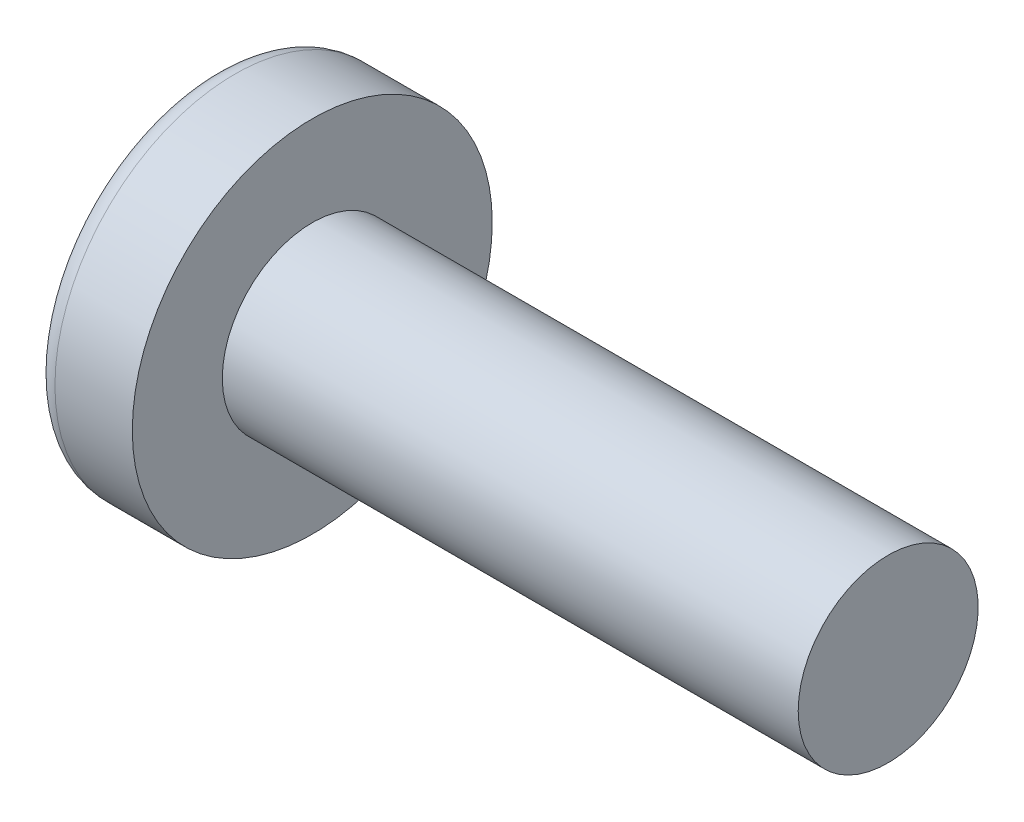
ISO-10303-21;
HEADER;
FILE_DESCRIPTION(('STEP AP214'),'2;1');
FILE_NAME('part.step','',(''),(''),'','','');
FILE_SCHEMA(('AUTOMOTIVE_DESIGN { 1 0 10303 214 1 1 1 1 }'));
ENDSEC;
DATA;
#1=APPLICATION_CONTEXT('core data for automotive mechanical design processes');
#2=APPLICATION_PROTOCOL_DEFINITION('international standard','automotive_design',2000,#1);
#3=PRODUCT_CONTEXT('',#1,'mechanical');
#4=PRODUCT('Part','Part','',(#3));
#5=PRODUCT_RELATED_PRODUCT_CATEGORY('part','',(#4));
#6=PRODUCT_DEFINITION_FORMATION('','',#4);
#7=PRODUCT_DEFINITION_CONTEXT('part definition',#1,'design');
#8=PRODUCT_DEFINITION('design','',#6,#7);
#9=PRODUCT_DEFINITION_SHAPE('','',#8);
#10=(LENGTH_UNIT() NAMED_UNIT(*) SI_UNIT(.MILLI.,.METRE.));
#11=(NAMED_UNIT(*) PLANE_ANGLE_UNIT() SI_UNIT($,.RADIAN.));
#12=(NAMED_UNIT(*) SI_UNIT($,.STERADIAN.) SOLID_ANGLE_UNIT());
#13=UNCERTAINTY_MEASURE_WITH_UNIT(LENGTH_MEASURE(1.E-05),#10,'distance_accuracy_value','');
#14=(GEOMETRIC_REPRESENTATION_CONTEXT(3) GLOBAL_UNCERTAINTY_ASSIGNED_CONTEXT((#13)) GLOBAL_UNIT_ASSIGNED_CONTEXT((#10,
#11,#12)) REPRESENTATION_CONTEXT('',''));
#15=CARTESIAN_POINT('',(0.,0.,0.));
#16=DIRECTION('',(0.,0.,1.));
#17=DIRECTION('',(1.,0.,0.));
#18=AXIS2_PLACEMENT_3D('',#15,#16,#17);
#19=CARTESIAN_POINT('',(4.,0.,0.));
#20=DIRECTION('',(-1.,0.,0.));
#21=DIRECTION('',(0.,1.,0.));
#22=AXIS2_PLACEMENT_3D('',#19,#20,#21);
#23=SPHERICAL_SURFACE('',#22,4.);
#24=CARTESIAN_POINT('',(0.783897344725729,0.,0.));
#25=DIRECTION('',(-1.,0.,0.));
#26=DIRECTION('',(0.,0.,1.));
#27=AXIS2_PLACEMENT_3D('',#24,#25,#26);
#28=CIRCLE('',#27,2.37837837837838);
#29=CARTESIAN_POINT('',(0.783897344725729,0.,2.37837837837838));
#30=VERTEX_POINT('',#29);
#31=EDGE_CURVE('E152',#30,#30,#28,.T.);
#32=ORIENTED_EDGE('',*,*,#31,.T.);
#33=EDGE_LOOP('',(#32));
#34=FACE_BOUND('',#33,.T.);
#35=CARTESIAN_POINT('',(3.98786118636742,-0.106127913473398,0.));
#36=DIRECTION('',(-0.11363816050966,-0.993522203313032,0.));
#37=DIRECTION('',(0.993522203313032,-0.11363816050966,0.));
#38=AXIS2_PLACEMENT_3D('',#35,#36,#37);
#39=CIRCLE('',#38,3.99857343501221);
#40=CARTESIAN_POINT('',(0.195539940029893,0.327634320584812,1.19110847703606));
#41=VERTEX_POINT('',#40);
#42=CARTESIAN_POINT('',(0.0301382525496408,0.346552814250857,0.346552814250858));
#43=VERTEX_POINT('',#42);
#44=EDGE_CURVE('E183',#41,#43,#39,.T.);
#45=ORIENTED_EDGE('',*,*,#44,.F.);
#46=CARTESIAN_POINT('',(3.17784904512422,0.,-1.07973473043772));
#47=DIRECTION('',(0.605808178465614,0.,0.795610740817502));
#48=DIRECTION('',(0.795610740817502,0.,-0.605808178465614));
#49=AXIS2_PLACEMENT_3D('',#46,#47,#48);
#50=CIRCLE('',#49,3.76274377539628);
#51=CARTESIAN_POINT('',(0.195539940029892,-0.32763432058482,1.19110847703606));
#52=VERTEX_POINT('',#51);
#53=EDGE_CURVE('E148',#41,#52,#50,.T.);
#54=ORIENTED_EDGE('',*,*,#53,.T.);
#55=CARTESIAN_POINT('',(3.98786118636742,0.106127913473397,0.));
#56=DIRECTION('',(-0.11363816050966,0.993522203313032,0.));
#57=DIRECTION('',(-0.993522203313032,-0.11363816050966,0.));
#58=AXIS2_PLACEMENT_3D('',#55,#56,#57);
#59=CIRCLE('',#58,3.99857343501221);
#60=CARTESIAN_POINT('',(0.0301382525496399,-0.346552814250859,0.346552814250858));
#61=VERTEX_POINT('',#60);
#62=EDGE_CURVE('E104',#61,#52,#59,.T.);
#63=ORIENTED_EDGE('',*,*,#62,.F.);
#64=CARTESIAN_POINT('',(3.98786118636742,0.,-0.106127913473397));
#65=DIRECTION('',(-0.11363816050966,0.,-0.993522203313032));
#66=DIRECTION('',(-0.993522203313032,0.,0.11363816050966));
#67=AXIS2_PLACEMENT_3D('',#64,#65,#66);
#68=CIRCLE('',#67,3.99857343501221);
#69=CARTESIAN_POINT('',(0.195539940029891,-1.19110847703606,0.327634320584816));
#70=VERTEX_POINT('',#69);
#71=EDGE_CURVE('E129',#70,#61,#68,.T.);
#72=ORIENTED_EDGE('',*,*,#71,.F.);
#73=CARTESIAN_POINT('',(3.17784904512422,1.07973473043772,0.));
#74=DIRECTION('',(0.605808178465614,-0.795610740817502,0.));
#75=DIRECTION('',(0.795610740817502,0.605808178465614,0.));
#76=AXIS2_PLACEMENT_3D('',#73,#74,#75);
#77=CIRCLE('',#76,3.76274377539627);
#78=CARTESIAN_POINT('',(0.195539940029891,-1.19110847703606,-0.327634320584816));
#79=VERTEX_POINT('',#78);
#80=EDGE_CURVE('E137',#70,#79,#77,.T.);
#81=ORIENTED_EDGE('',*,*,#80,.T.);
#82=CARTESIAN_POINT('',(3.98786118636742,0.,0.106127913473398));
#83=DIRECTION('',(-0.11363816050966,0.,0.993522203313032));
#84=DIRECTION('',(0.993522203313032,0.,0.11363816050966));
#85=AXIS2_PLACEMENT_3D('',#82,#83,#84);
#86=CIRCLE('',#85,3.99857343501221);
#87=CARTESIAN_POINT('',(0.0301382525496399,-0.346552814250856,-0.346552814250858));
#88=VERTEX_POINT('',#87);
#89=EDGE_CURVE('E47',#88,#79,#86,.T.);
#90=ORIENTED_EDGE('',*,*,#89,.F.);
#91=CARTESIAN_POINT('',(0.195539940029892,-0.327634320584811,-1.19110847703606));
#92=VERTEX_POINT('',#91);
#93=EDGE_CURVE('E190',#92,#88,#59,.T.);
#94=ORIENTED_EDGE('',*,*,#93,.F.);
#95=CARTESIAN_POINT('',(3.17784904512422,0.,1.07973473043772));
#96=DIRECTION('',(0.605808178465614,0.,-0.795610740817502));
#97=DIRECTION('',(-0.795610740817502,0.,-0.605808178465614));
#98=AXIS2_PLACEMENT_3D('',#95,#96,#97);
#99=CIRCLE('',#98,3.76274377539628);
#100=CARTESIAN_POINT('',(0.195539940029893,0.32763432058482,-1.19110847703606));
#101=VERTEX_POINT('',#100);
#102=EDGE_CURVE('E130',#92,#101,#99,.T.);
#103=ORIENTED_EDGE('',*,*,#102,.T.);
#104=CARTESIAN_POINT('',(0.0301382525496408,0.346552814250859,-0.346552814250858));
#105=VERTEX_POINT('',#104);
#106=EDGE_CURVE('E178',#105,#101,#39,.T.);
#107=ORIENTED_EDGE('',*,*,#106,.F.);
#108=CARTESIAN_POINT('',(0.195539940029894,1.19110847703606,-0.327634320584816));
#109=VERTEX_POINT('',#108);
#110=EDGE_CURVE('E40',#109,#105,#86,.T.);
#111=ORIENTED_EDGE('',*,*,#110,.F.);
#112=CARTESIAN_POINT('',(3.17784904512422,-1.07973473043772,0.));
#113=DIRECTION('',(0.605808178465614,0.795610740817502,0.));
#114=DIRECTION('',(-0.795610740817502,0.605808178465614,0.));
#115=AXIS2_PLACEMENT_3D('',#112,#113,#114);
#116=CIRCLE('',#115,3.76274377539628);
#117=CARTESIAN_POINT('',(0.195539940029894,1.19110847703606,0.327634320584816));
#118=VERTEX_POINT('',#117);
#119=EDGE_CURVE('E11',#109,#118,#116,.T.);
#120=ORIENTED_EDGE('',*,*,#119,.T.);
#121=EDGE_CURVE('E166',#43,#118,#68,.T.);
#122=ORIENTED_EDGE('',*,*,#121,.F.);
#123=EDGE_LOOP('',(#45,#54,#63,#72,#81,#90,#94,#103,#107,#111,#120,#122));
#124=FACE_BOUND('',#123,.T.);
#125=ADVANCED_FACE('F32',(#34,#124),#23,.T.);
#126=CARTESIAN_POINT('',(1.75982832618026,0.,-0.148712446351931));
#127=DIRECTION('',(-0.11363816050966,0.,0.993522203313032));
#128=DIRECTION('',(0.993522203313032,0.,0.11363816050966));
#129=AXIS2_PLACEMENT_3D('',#126,#127,#128);
#130=PLANE('',#129);
#131=ORIENTED_EDGE('',*,*,#110,.T.);
#132=DIRECTION('',(0.987168682960152,-0.112911450665377,0.112911450665377));
#133=VECTOR('',#132,1.);
#134=CARTESIAN_POINT('',(1.77640420924781,0.146816512014139,-0.146816512014139));
#135=LINE('',#134,#133);
#136=CARTESIAN_POINT('',(1.53,0.175000000000001,-0.174999999999999));
#137=VERTEX_POINT('',#136);
#138=EDGE_CURVE('E172',#105,#137,#135,.T.);
#139=ORIENTED_EDGE('',*,*,#138,.T.);
#140=DIRECTION('',(0.792336746135061,-0.603315234802187,0.0906267520089123));
#141=VECTOR('',#140,1.);
#142=CARTESIAN_POINT('',(0.,1.34,-0.35));
#143=LINE('',#142,#141);
#144=EDGE_CURVE('E153',#109,#137,#143,.T.);
#145=ORIENTED_EDGE('',*,*,#144,.F.);
#146=EDGE_LOOP('',(#131,#139,#145));
#147=FACE_BOUND('',#146,.T.);
#148=ADVANCED_FACE('F171',(#147),#130,.T.);
#149=DIRECTION('',(0.792336746135062,0.603315234802187,0.0906267520089123));
#150=VECTOR('',#149,1.);
#151=CARTESIAN_POINT('',(0.,-1.34,-0.35));
#152=LINE('',#151,#150);
#153=CARTESIAN_POINT('',(1.53,-0.175,-0.175));
#154=VERTEX_POINT('',#153);
#155=EDGE_CURVE('E138',#79,#154,#152,.T.);
#156=ORIENTED_EDGE('',*,*,#155,.T.);
#157=DIRECTION('',(-0.987168682960152,-0.112911450665376,-0.112911450665377));
#158=VECTOR('',#157,1.);
#159=CARTESIAN_POINT('',(1.77640420924781,-0.146816512014139,-0.146816512014139));
#160=LINE('',#159,#158);
#161=EDGE_CURVE('E193',#154,#88,#160,.T.);
#162=ORIENTED_EDGE('',*,*,#161,.T.);
#163=ORIENTED_EDGE('',*,*,#89,.T.);
#164=EDGE_LOOP('',(#156,#162,#163));
#165=FACE_BOUND('',#164,.T.);
#166=ADVANCED_FACE('F208',(#165),#130,.T.);
#167=CARTESIAN_POINT('',(1.75982832618026,0.,0.148712446351931));
#168=DIRECTION('',(-0.11363816050966,0.,-0.993522203313032));
#169=DIRECTION('',(-0.993522203313032,0.,0.11363816050966));
#170=AXIS2_PLACEMENT_3D('',#167,#168,#169);
#171=PLANE('',#170);
#172=DIRECTION('',(0.792336746135061,-0.603315234802187,-0.0906267520089121));
#173=VECTOR('',#172,1.);
#174=CARTESIAN_POINT('',(0.,1.34,0.35));
#175=LINE('',#174,#173);
#176=CARTESIAN_POINT('',(1.53,0.175,0.175));
#177=VERTEX_POINT('',#176);
#178=EDGE_CURVE('E209',#118,#177,#175,.T.);
#179=ORIENTED_EDGE('',*,*,#178,.T.);
#180=DIRECTION('',(-0.987168682960152,0.112911450665376,0.112911450665376));
#181=VECTOR('',#180,1.);
#182=CARTESIAN_POINT('',(1.77640420924781,0.146816512014138,0.146816512014139));
#183=LINE('',#182,#181);
#184=EDGE_CURVE('E187',#177,#43,#183,.T.);
#185=ORIENTED_EDGE('',*,*,#184,.T.);
#186=ORIENTED_EDGE('',*,*,#121,.T.);
#187=EDGE_LOOP('',(#179,#185,#186));
#188=FACE_BOUND('',#187,.T.);
#189=ADVANCED_FACE('F213',(#188),#171,.T.);
#190=ORIENTED_EDGE('',*,*,#71,.T.);
#191=DIRECTION('',(0.987168682960152,0.112911450665377,-0.112911450665376));
#192=VECTOR('',#191,1.);
#193=CARTESIAN_POINT('',(1.77640420924781,-0.14681651201414,0.146816512014139));
#194=LINE('',#193,#192);
#195=CARTESIAN_POINT('',(1.53,-0.175000000000001,0.174999999999999));
#196=VERTEX_POINT('',#195);
#197=EDGE_CURVE('E102',#61,#196,#194,.T.);
#198=ORIENTED_EDGE('',*,*,#197,.T.);
#199=DIRECTION('',(0.792336746135062,0.603315234802187,-0.0906267520089119));
#200=VECTOR('',#199,1.);
#201=CARTESIAN_POINT('',(0.,-1.34,0.349999999999999));
#202=LINE('',#201,#200);
#203=EDGE_CURVE('E127',#70,#196,#202,.T.);
#204=ORIENTED_EDGE('',*,*,#203,.F.);
#205=EDGE_LOOP('',(#190,#198,#204));
#206=FACE_BOUND('',#205,.T.);
#207=ADVANCED_FACE('F126',(#206),#171,.T.);
#208=CARTESIAN_POINT('',(-25.4,0.,0.));
#209=DIRECTION('',(-1.,0.,0.));
#210=DIRECTION('',(0.,0.,1.));
#211=AXIS2_PLACEMENT_3D('',#208,#209,#210);
#212=CYLINDRICAL_SURFACE('',#211,1.25);
#213=CARTESIAN_POINT('',(10.1,0.,0.));
#214=DIRECTION('',(-1.,0.,0.));
#215=DIRECTION('',(0.,0.,1.));
#216=AXIS2_PLACEMENT_3D('',#213,#214,#215);
#217=CIRCLE('',#216,1.25);
#218=CARTESIAN_POINT('',(10.1,0.,1.25));
#219=VERTEX_POINT('',#218);
#220=EDGE_CURVE('E149',#219,#219,#217,.T.);
#221=ORIENTED_EDGE('',*,*,#220,.T.);
#222=EDGE_LOOP('',(#221));
#223=FACE_BOUND('',#222,.T.);
#224=CARTESIAN_POINT('',(2.1,0.,0.));
#225=DIRECTION('',(-1.,0.,0.));
#226=DIRECTION('',(0.,0.,1.));
#227=AXIS2_PLACEMENT_3D('',#224,#225,#226);
#228=CIRCLE('',#227,1.25);
#229=CARTESIAN_POINT('',(2.1,0.,1.25));
#230=VERTEX_POINT('',#229);
#231=EDGE_CURVE('E162',#230,#230,#228,.T.);
#232=ORIENTED_EDGE('',*,*,#231,.F.);
#233=EDGE_LOOP('',(#232));
#234=FACE_BOUND('',#233,.T.);
#235=ADVANCED_FACE('F34',(#223,#234),#212,.T.);
#236=CARTESIAN_POINT('',(2.1,1.25,0.));
#237=DIRECTION('',(-1.,0.,0.));
#238=DIRECTION('',(0.,0.,1.));
#239=AXIS2_PLACEMENT_3D('',#236,#237,#238);
#240=PLANE('',#239);
#241=CARTESIAN_POINT('',(2.1,0.,0.));
#242=DIRECTION('',(-1.,0.,0.));
#243=DIRECTION('',(0.,0.,1.));
#244=AXIS2_PLACEMENT_3D('',#241,#242,#243);
#245=CIRCLE('',#244,2.5);
#246=CARTESIAN_POINT('',(2.1,0.,2.5));
#247=VERTEX_POINT('',#246);
#248=EDGE_CURVE('E159',#247,#247,#245,.T.);
#249=ORIENTED_EDGE('',*,*,#248,.F.);
#250=EDGE_LOOP('',(#249));
#251=FACE_BOUND('',#250,.T.);
#252=ORIENTED_EDGE('',*,*,#231,.T.);
#253=EDGE_LOOP('',(#252));
#254=FACE_BOUND('',#253,.T.);
#255=ADVANCED_FACE('F241',(#251,#254),#240,.F.);
#256=CARTESIAN_POINT('',(-25.4,0.,0.));
#257=DIRECTION('',(-1.,0.,0.));
#258=DIRECTION('',(0.,0.,1.));
#259=AXIS2_PLACEMENT_3D('',#256,#257,#258);
#260=CYLINDRICAL_SURFACE('',#259,2.5);
#261=ORIENTED_EDGE('',*,*,#248,.T.);
#262=EDGE_LOOP('',(#261));
#263=FACE_BOUND('',#262,.T.);
#264=CARTESIAN_POINT('',(1.0251050438713,0.,0.));
#265=DIRECTION('',(-1.,0.,0.));
#266=DIRECTION('',(0.,0.,1.));
#267=AXIS2_PLACEMENT_3D('',#264,#265,#266);
#268=CIRCLE('',#267,2.5);
#269=CARTESIAN_POINT('',(1.0251050438713,0.,2.5));
#270=VERTEX_POINT('',#269);
#271=EDGE_CURVE('E156',#270,#270,#268,.T.);
#272=ORIENTED_EDGE('',*,*,#271,.F.);
#273=EDGE_LOOP('',(#272));
#274=FACE_BOUND('',#273,.T.);
#275=ADVANCED_FACE('F238',(#263,#274),#260,.T.);
#276=CARTESIAN_POINT('',(1.0251050438713,0.,0.));
#277=DIRECTION('',(-1.,0.,0.));
#278=DIRECTION('',(0.,0.,1.));
#279=AXIS2_PLACEMENT_3D('',#276,#277,#278);
#280=TOROIDAL_SURFACE('',#279,2.2,0.3);
#281=ORIENTED_EDGE('',*,*,#271,.T.);
#282=EDGE_LOOP('',(#281));
#283=FACE_BOUND('',#282,.T.);
#284=ORIENTED_EDGE('',*,*,#31,.F.);
#285=EDGE_LOOP('',(#284));
#286=FACE_BOUND('',#285,.T.);
#287=ADVANCED_FACE('F235',(#283,#286),#280,.T.);
#288=CARTESIAN_POINT('',(10.1,1.25,0.));
#289=DIRECTION('',(1.,0.,0.));
#290=DIRECTION('',(0.,0.,-1.));
#291=AXIS2_PLACEMENT_3D('',#288,#289,#290);
#292=PLANE('',#291);
#293=ORIENTED_EDGE('',*,*,#220,.F.);
#294=EDGE_LOOP('',(#293));
#295=FACE_BOUND('',#294,.T.);
#296=ADVANCED_FACE('F233',(#295),#292,.T.);
#297=CARTESIAN_POINT('',(0.,1.34,0.35));
#298=DIRECTION('',(0.605808178465614,0.795610740817502,0.));
#299=DIRECTION('',(-0.795610740817502,0.605808178465614,0.));
#300=AXIS2_PLACEMENT_3D('',#297,#298,#299);
#301=PLANE('',#300);
#302=ORIENTED_EDGE('',*,*,#144,.T.);
#303=DIRECTION('',(0.,0.,-1.));
#304=VECTOR('',#303,1.);
#305=CARTESIAN_POINT('',(1.53,0.175,0.175));
#306=LINE('',#305,#304);
#307=EDGE_CURVE('E120',#177,#137,#306,.T.);
#308=ORIENTED_EDGE('',*,*,#307,.F.);
#309=ORIENTED_EDGE('',*,*,#178,.F.);
#310=ORIENTED_EDGE('',*,*,#119,.F.);
#311=EDGE_LOOP('',(#302,#308,#309,#310));
#312=FACE_BOUND('',#311,.T.);
#313=ADVANCED_FACE('F212',(#312),#301,.F.);
#314=CARTESIAN_POINT('',(0.,-1.34,-0.35));
#315=DIRECTION('',(0.605808178465614,-0.795610740817502,0.));
#316=DIRECTION('',(0.795610740817502,0.605808178465614,0.));
#317=AXIS2_PLACEMENT_3D('',#314,#315,#316);
#318=PLANE('',#317);
#319=ORIENTED_EDGE('',*,*,#203,.T.);
#320=DIRECTION('',(0.,0.,1.));
#321=VECTOR('',#320,1.);
#322=CARTESIAN_POINT('',(1.53,-0.175,-0.175));
#323=LINE('',#322,#321);
#324=EDGE_CURVE('E119',#154,#196,#323,.T.);
#325=ORIENTED_EDGE('',*,*,#324,.F.);
#326=ORIENTED_EDGE('',*,*,#155,.F.);
#327=ORIENTED_EDGE('',*,*,#80,.F.);
#328=EDGE_LOOP('',(#319,#325,#326,#327));
#329=FACE_BOUND('',#328,.T.);
#330=ADVANCED_FACE('F134',(#329),#318,.F.);
#331=CARTESIAN_POINT('',(1.53,0.175,-0.175));
#332=DIRECTION('',(-1.,0.,0.));
#333=DIRECTION('',(0.,0.,1.));
#334=AXIS2_PLACEMENT_3D('',#331,#332,#333);
#335=PLANE('',#334);
#336=DIRECTION('',(0.,1.,0.));
#337=VECTOR('',#336,1.);
#338=CARTESIAN_POINT('',(1.53,-0.175,-0.175));
#339=LINE('',#338,#337);
#340=EDGE_CURVE('E142',#154,#137,#339,.T.);
#341=ORIENTED_EDGE('',*,*,#340,.F.);
#342=ORIENTED_EDGE('',*,*,#324,.T.);
#343=DIRECTION('',(0.,-1.,0.));
#344=VECTOR('',#343,1.);
#345=CARTESIAN_POINT('',(1.53,0.175,0.175));
#346=LINE('',#345,#344);
#347=EDGE_CURVE('E111',#177,#196,#346,.T.);
#348=ORIENTED_EDGE('',*,*,#347,.F.);
#349=ORIENTED_EDGE('',*,*,#307,.T.);
#350=EDGE_LOOP('',(#341,#342,#348,#349));
#351=FACE_BOUND('',#350,.T.);
#352=ADVANCED_FACE('F140',(#351),#335,.T.);
#353=CARTESIAN_POINT('',(0.,0.350000000000005,-1.34));
#354=DIRECTION('',(0.605808178465614,0.,-0.795610740817502));
#355=DIRECTION('',(0.795610740817502,0.,0.605808178465614));
#356=AXIS2_PLACEMENT_3D('',#353,#354,#355);
#357=PLANE('',#356);
#358=DIRECTION('',(0.792336746135062,0.0906267520089098,0.603315234802187));
#359=VECTOR('',#358,1.);
#360=CARTESIAN_POINT('',(0.,-0.349999999999995,-1.34));
#361=LINE('',#360,#359);
#362=EDGE_CURVE('E198',#92,#154,#361,.T.);
#363=ORIENTED_EDGE('',*,*,#362,.T.);
#364=ORIENTED_EDGE('',*,*,#340,.T.);
#365=DIRECTION('',(0.792336746135062,-0.0906267520089144,0.603315234802187));
#366=VECTOR('',#365,1.);
#367=CARTESIAN_POINT('',(0.,0.350000000000005,-1.34));
#368=LINE('',#367,#366);
#369=EDGE_CURVE('E108',#101,#137,#368,.T.);
#370=ORIENTED_EDGE('',*,*,#369,.F.);
#371=ORIENTED_EDGE('',*,*,#102,.F.);
#372=EDGE_LOOP('',(#363,#364,#370,#371));
#373=FACE_BOUND('',#372,.T.);
#374=ADVANCED_FACE('F203',(#373),#357,.F.);
#375=CARTESIAN_POINT('',(1.75982832618026,-0.148712446351931,0.));
#376=DIRECTION('',(-0.11363816050966,0.993522203313032,0.));
#377=DIRECTION('',(-0.993522203313032,-0.11363816050966,0.));
#378=AXIS2_PLACEMENT_3D('',#375,#376,#377);
#379=PLANE('',#378);
#380=ORIENTED_EDGE('',*,*,#93,.T.);
#381=ORIENTED_EDGE('',*,*,#161,.F.);
#382=ORIENTED_EDGE('',*,*,#362,.F.);
#383=EDGE_LOOP('',(#380,#381,#382));
#384=FACE_BOUND('',#383,.T.);
#385=ADVANCED_FACE('F207',(#384),#379,.T.);
#386=CARTESIAN_POINT('',(1.75982832618026,0.148712446351931,0.));
#387=DIRECTION('',(-0.11363816050966,-0.993522203313032,0.));
#388=DIRECTION('',(0.993522203313032,-0.11363816050966,0.));
#389=AXIS2_PLACEMENT_3D('',#386,#387,#388);
#390=PLANE('',#389);
#391=ORIENTED_EDGE('',*,*,#106,.T.);
#392=ORIENTED_EDGE('',*,*,#369,.T.);
#393=ORIENTED_EDGE('',*,*,#138,.F.);
#394=EDGE_LOOP('',(#391,#392,#393));
#395=FACE_BOUND('',#394,.T.);
#396=ADVANCED_FACE('F201',(#395),#390,.T.);
#397=CARTESIAN_POINT('',(0.,-0.350000000000004,1.34));
#398=DIRECTION('',(0.605808178465614,0.,0.795610740817502));
#399=DIRECTION('',(-0.795610740817502,0.,0.605808178465614));
#400=AXIS2_PLACEMENT_3D('',#397,#398,#399);
#401=PLANE('',#400);
#402=DIRECTION('',(0.792336746135061,-0.0906267520089102,-0.603315234802188));
#403=VECTOR('',#402,1.);
#404=CARTESIAN_POINT('',(0.,0.349999999999995,1.34));
#405=LINE('',#404,#403);
#406=EDGE_CURVE('E107',#41,#177,#405,.T.);
#407=ORIENTED_EDGE('',*,*,#406,.T.);
#408=ORIENTED_EDGE('',*,*,#347,.T.);
#409=DIRECTION('',(0.792336746135061,0.0906267520089142,-0.603315234802187));
#410=VECTOR('',#409,1.);
#411=CARTESIAN_POINT('',(0.,-0.350000000000004,1.34));
#412=LINE('',#411,#410);
#413=EDGE_CURVE('E98',#52,#196,#412,.T.);
#414=ORIENTED_EDGE('',*,*,#413,.F.);
#415=ORIENTED_EDGE('',*,*,#53,.F.);
#416=EDGE_LOOP('',(#407,#408,#414,#415));
#417=FACE_BOUND('',#416,.T.);
#418=ADVANCED_FACE('F112',(#417),#401,.F.);
#419=ORIENTED_EDGE('',*,*,#44,.T.);
#420=ORIENTED_EDGE('',*,*,#184,.F.);
#421=ORIENTED_EDGE('',*,*,#406,.F.);
#422=EDGE_LOOP('',(#419,#420,#421));
#423=FACE_BOUND('',#422,.T.);
#424=ADVANCED_FACE('F214',(#423),#390,.T.);
#425=ORIENTED_EDGE('',*,*,#62,.T.);
#426=ORIENTED_EDGE('',*,*,#413,.T.);
#427=ORIENTED_EDGE('',*,*,#197,.F.);
#428=EDGE_LOOP('',(#425,#426,#427));
#429=FACE_BOUND('',#428,.T.);
#430=ADVANCED_FACE('F100',(#429),#379,.T.);
#431=CLOSED_SHELL('',(#125,#148,#166,#189,#207,#235,#255,#275,#287,#296,#313,#330,#352,#374,
#385,#396,#418,#424,#430));
#432=MANIFOLD_SOLID_BREP('B2',#431);
#433=ADVANCED_BREP_SHAPE_REPRESENTATION('',(#18,#432),#14);
#434=SHAPE_DEFINITION_REPRESENTATION(#9,#433);
ENDSEC;
END-ISO-10303-21;
